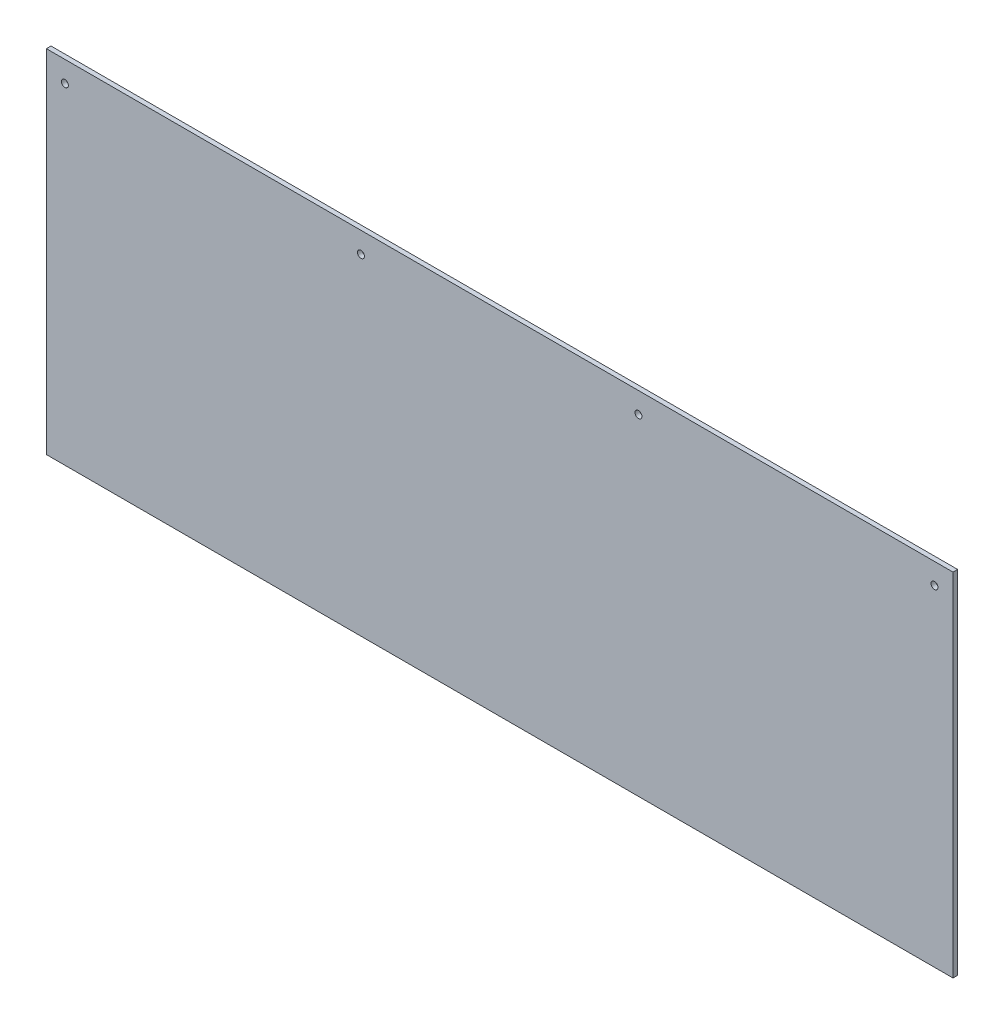
ISO-10303-21;
HEADER;
FILE_DESCRIPTION(('STEP AP214'),'2;1');
FILE_NAME('part.step','',(''),(''),'','','');
FILE_SCHEMA(('AUTOMOTIVE_DESIGN { 1 0 10303 214 1 1 1 1 }'));
ENDSEC;
DATA;
#1=APPLICATION_CONTEXT('core data for automotive mechanical design processes');
#2=APPLICATION_PROTOCOL_DEFINITION('international standard','automotive_design',2000,#1);
#3=PRODUCT_CONTEXT('',#1,'mechanical');
#4=PRODUCT('Part','Part','',(#3));
#5=PRODUCT_RELATED_PRODUCT_CATEGORY('part','',(#4));
#6=PRODUCT_DEFINITION_FORMATION('','',#4);
#7=PRODUCT_DEFINITION_CONTEXT('part definition',#1,'design');
#8=PRODUCT_DEFINITION('design','',#6,#7);
#9=PRODUCT_DEFINITION_SHAPE('','',#8);
#10=(LENGTH_UNIT() NAMED_UNIT(*) SI_UNIT(.MILLI.,.METRE.));
#11=(NAMED_UNIT(*) PLANE_ANGLE_UNIT() SI_UNIT($,.RADIAN.));
#12=(NAMED_UNIT(*) SI_UNIT($,.STERADIAN.) SOLID_ANGLE_UNIT());
#13=UNCERTAINTY_MEASURE_WITH_UNIT(LENGTH_MEASURE(1.E-05),#10,'distance_accuracy_value','');
#14=(GEOMETRIC_REPRESENTATION_CONTEXT(3) GLOBAL_UNCERTAINTY_ASSIGNED_CONTEXT((#13)) GLOBAL_UNIT_ASSIGNED_CONTEXT((#10,
#11,#12)) REPRESENTATION_CONTEXT('',''));
#15=CARTESIAN_POINT('',(0.,0.,0.));
#16=DIRECTION('',(0.,0.,1.));
#17=DIRECTION('',(1.,0.,0.));
#18=AXIS2_PLACEMENT_3D('',#15,#16,#17);
#19=CARTESIAN_POINT('',(0.,0.,6.35));
#20=DIRECTION('',(0.,0.,1.));
#21=DIRECTION('',(1.,0.,0.));
#22=AXIS2_PLACEMENT_3D('',#19,#20,#21);
#23=PLANE('',#22);
#24=CARTESIAN_POINT('',(1219.2,454.025,6.35));
#25=DIRECTION('',(0.,0.,1.));
#26=DIRECTION('',(1.,0.,0.));
#27=AXIS2_PLACEMENT_3D('',#24,#25,#26);
#28=CIRCLE('',#27,4.7625);
#29=CARTESIAN_POINT('',(1223.9625,454.025,6.35));
#30=VERTEX_POINT('',#29);
#31=EDGE_CURVE('E92',#30,#30,#28,.F.);
#32=ORIENTED_EDGE('',*,*,#31,.T.);
#33=EDGE_LOOP('',(#32));
#34=FACE_BOUND('',#33,.T.);
#35=CARTESIAN_POINT('',(812.8,454.025,6.35));
#36=DIRECTION('',(0.,0.,1.));
#37=DIRECTION('',(1.,0.,0.));
#38=AXIS2_PLACEMENT_3D('',#35,#36,#37);
#39=CIRCLE('',#38,4.7625);
#40=CARTESIAN_POINT('',(817.5625,454.025,6.35));
#41=VERTEX_POINT('',#40);
#42=EDGE_CURVE('E95',#41,#41,#39,.F.);
#43=ORIENTED_EDGE('',*,*,#42,.T.);
#44=EDGE_LOOP('',(#43));
#45=FACE_BOUND('',#44,.T.);
#46=CARTESIAN_POINT('',(431.8,454.025,6.35));
#47=DIRECTION('',(0.,0.,1.));
#48=DIRECTION('',(1.,0.,0.));
#49=AXIS2_PLACEMENT_3D('',#46,#47,#48);
#50=CIRCLE('',#49,4.7625);
#51=CARTESIAN_POINT('',(436.5625,454.025,6.35));
#52=VERTEX_POINT('',#51);
#53=EDGE_CURVE('E97',#52,#52,#50,.F.);
#54=ORIENTED_EDGE('',*,*,#53,.T.);
#55=EDGE_LOOP('',(#54));
#56=FACE_BOUND('',#55,.T.);
#57=CARTESIAN_POINT('',(25.4,454.025,6.35));
#58=DIRECTION('',(0.,0.,1.));
#59=DIRECTION('',(1.,0.,0.));
#60=AXIS2_PLACEMENT_3D('',#57,#58,#59);
#61=CIRCLE('',#60,4.7625);
#62=CARTESIAN_POINT('',(30.1625,454.025,6.35));
#63=VERTEX_POINT('',#62);
#64=EDGE_CURVE('E20',#63,#63,#61,.F.);
#65=ORIENTED_EDGE('',*,*,#64,.T.);
#66=EDGE_LOOP('',(#65));
#67=FACE_BOUND('',#66,.T.);
#68=DIRECTION('',(0.,1.,0.));
#69=VECTOR('',#68,1.);
#70=CARTESIAN_POINT('',(0.,482.6,6.35));
#71=LINE('',#70,#69);
#72=CARTESIAN_POINT('',(0.,0.,6.35));
#73=VERTEX_POINT('',#72);
#74=CARTESIAN_POINT('',(0.,482.6,6.35));
#75=VERTEX_POINT('',#74);
#76=EDGE_CURVE('E71',#73,#75,#71,.T.);
#77=ORIENTED_EDGE('',*,*,#76,.F.);
#78=DIRECTION('',(1.,0.,0.));
#79=VECTOR('',#78,1.);
#80=CARTESIAN_POINT('',(0.,0.,6.35));
#81=LINE('',#80,#79);
#82=CARTESIAN_POINT('',(1244.6,0.,6.35));
#83=VERTEX_POINT('',#82);
#84=EDGE_CURVE('E68',#83,#73,#81,.F.);
#85=ORIENTED_EDGE('',*,*,#84,.F.);
#86=DIRECTION('',(0.,1.,0.));
#87=VECTOR('',#86,1.);
#88=CARTESIAN_POINT('',(1244.6,0.,6.35));
#89=LINE('',#88,#87);
#90=CARTESIAN_POINT('',(1244.6,482.6,6.35));
#91=VERTEX_POINT('',#90);
#92=EDGE_CURVE('E59',#91,#83,#89,.F.);
#93=ORIENTED_EDGE('',*,*,#92,.F.);
#94=DIRECTION('',(1.,0.,0.));
#95=VECTOR('',#94,1.);
#96=CARTESIAN_POINT('',(1244.6,482.6,6.35));
#97=LINE('',#96,#95);
#98=EDGE_CURVE('E54',#75,#91,#97,.T.);
#99=ORIENTED_EDGE('',*,*,#98,.F.);
#100=EDGE_LOOP('',(#77,#85,#93,#99));
#101=FACE_BOUND('',#100,.T.);
#102=ADVANCED_FACE('F17',(#34,#45,#56,#67,#101),#23,.T.);
#103=CARTESIAN_POINT('',(0.,0.,0.));
#104=DIRECTION('',(0.,-1.,0.));
#105=DIRECTION('',(0.,0.,-1.));
#106=AXIS2_PLACEMENT_3D('',#103,#104,#105);
#107=PLANE('',#106);
#108=DIRECTION('',(0.,0.,1.));
#109=VECTOR('',#108,1.);
#110=CARTESIAN_POINT('',(0.,0.,0.));
#111=LINE('',#110,#109);
#112=CARTESIAN_POINT('',(0.,0.,0.));
#113=VERTEX_POINT('',#112);
#114=EDGE_CURVE('E105',#113,#73,#111,.T.);
#115=ORIENTED_EDGE('',*,*,#114,.F.);
#116=DIRECTION('',(1.,0.,0.));
#117=VECTOR('',#116,1.);
#118=CARTESIAN_POINT('',(0.,0.,0.));
#119=LINE('',#118,#117);
#120=CARTESIAN_POINT('',(1244.6,0.,0.));
#121=VERTEX_POINT('',#120);
#122=EDGE_CURVE('E78',#113,#121,#119,.T.);
#123=ORIENTED_EDGE('',*,*,#122,.T.);
#124=DIRECTION('',(0.,0.,-1.));
#125=VECTOR('',#124,1.);
#126=CARTESIAN_POINT('',(1244.6,0.,0.));
#127=LINE('',#126,#125);
#128=EDGE_CURVE('E64',#83,#121,#127,.T.);
#129=ORIENTED_EDGE('',*,*,#128,.F.);
#130=ORIENTED_EDGE('',*,*,#84,.T.);
#131=EDGE_LOOP('',(#115,#123,#129,#130));
#132=FACE_BOUND('',#131,.T.);
#133=ADVANCED_FACE('F77',(#132),#107,.T.);
#134=CARTESIAN_POINT('',(1244.6,0.,0.));
#135=DIRECTION('',(1.,0.,0.));
#136=DIRECTION('',(0.,0.,-1.));
#137=AXIS2_PLACEMENT_3D('',#134,#135,#136);
#138=PLANE('',#137);
#139=ORIENTED_EDGE('',*,*,#128,.T.);
#140=DIRECTION('',(0.,1.,0.));
#141=VECTOR('',#140,1.);
#142=CARTESIAN_POINT('',(1244.6,0.,0.));
#143=LINE('',#142,#141);
#144=CARTESIAN_POINT('',(1244.6,482.6,0.));
#145=VERTEX_POINT('',#144);
#146=EDGE_CURVE('E116',#121,#145,#143,.T.);
#147=ORIENTED_EDGE('',*,*,#146,.T.);
#148=DIRECTION('',(0.,0.,1.));
#149=VECTOR('',#148,1.);
#150=CARTESIAN_POINT('',(1244.6,482.6,0.));
#151=LINE('',#150,#149);
#152=EDGE_CURVE('E66',#91,#145,#151,.F.);
#153=ORIENTED_EDGE('',*,*,#152,.F.);
#154=ORIENTED_EDGE('',*,*,#92,.T.);
#155=EDGE_LOOP('',(#139,#147,#153,#154));
#156=FACE_BOUND('',#155,.T.);
#157=ADVANCED_FACE('F61',(#156),#138,.T.);
#158=CARTESIAN_POINT('',(1244.6,482.6,0.));
#159=DIRECTION('',(0.,1.,0.));
#160=DIRECTION('',(0.,0.,1.));
#161=AXIS2_PLACEMENT_3D('',#158,#159,#160);
#162=PLANE('',#161);
#163=ORIENTED_EDGE('',*,*,#152,.T.);
#164=DIRECTION('',(1.,0.,0.));
#165=VECTOR('',#164,1.);
#166=CARTESIAN_POINT('',(0.,482.6,0.));
#167=LINE('',#166,#165);
#168=CARTESIAN_POINT('',(0.,482.6,0.));
#169=VERTEX_POINT('',#168);
#170=EDGE_CURVE('E113',#145,#169,#167,.F.);
#171=ORIENTED_EDGE('',*,*,#170,.T.);
#172=DIRECTION('',(0.,0.,1.));
#173=VECTOR('',#172,1.);
#174=CARTESIAN_POINT('',(0.,482.6,0.));
#175=LINE('',#174,#173);
#176=EDGE_CURVE('E35',#75,#169,#175,.F.);
#177=ORIENTED_EDGE('',*,*,#176,.F.);
#178=ORIENTED_EDGE('',*,*,#98,.T.);
#179=EDGE_LOOP('',(#163,#171,#177,#178));
#180=FACE_BOUND('',#179,.T.);
#181=ADVANCED_FACE('F112',(#180),#162,.T.);
#182=CARTESIAN_POINT('',(0.,482.6,0.));
#183=DIRECTION('',(-1.,0.,0.));
#184=DIRECTION('',(0.,0.,1.));
#185=AXIS2_PLACEMENT_3D('',#182,#183,#184);
#186=PLANE('',#185);
#187=ORIENTED_EDGE('',*,*,#176,.T.);
#188=DIRECTION('',(0.,1.,0.));
#189=VECTOR('',#188,1.);
#190=CARTESIAN_POINT('',(0.,0.,0.));
#191=LINE('',#190,#189);
#192=EDGE_CURVE('E91',#169,#113,#191,.F.);
#193=ORIENTED_EDGE('',*,*,#192,.T.);
#194=ORIENTED_EDGE('',*,*,#114,.T.);
#195=ORIENTED_EDGE('',*,*,#76,.T.);
#196=EDGE_LOOP('',(#187,#193,#194,#195));
#197=FACE_BOUND('',#196,.T.);
#198=ADVANCED_FACE('F119',(#197),#186,.T.);
#199=CARTESIAN_POINT('',(25.4,454.025,0.));
#200=DIRECTION('',(0.,0.,1.));
#201=DIRECTION('',(1.,0.,0.));
#202=AXIS2_PLACEMENT_3D('',#199,#200,#201);
#203=CYLINDRICAL_SURFACE('',#202,4.7625);
#204=ORIENTED_EDGE('',*,*,#64,.F.);
#205=EDGE_LOOP('',(#204));
#206=FACE_BOUND('',#205,.T.);
#207=CARTESIAN_POINT('',(25.4,454.025,0.));
#208=DIRECTION('',(0.,0.,1.));
#209=DIRECTION('',(1.,0.,0.));
#210=AXIS2_PLACEMENT_3D('',#207,#208,#209);
#211=CIRCLE('',#210,4.7625);
#212=CARTESIAN_POINT('',(30.1625,454.025,0.));
#213=VERTEX_POINT('',#212);
#214=EDGE_CURVE('E88',#213,#213,#211,.F.);
#215=ORIENTED_EDGE('',*,*,#214,.T.);
#216=EDGE_LOOP('',(#215));
#217=FACE_BOUND('',#216,.T.);
#218=ADVANCED_FACE('F121',(#206,#217),#203,.F.);
#219=CARTESIAN_POINT('',(431.8,454.025,0.));
#220=DIRECTION('',(0.,0.,1.));
#221=DIRECTION('',(1.,0.,0.));
#222=AXIS2_PLACEMENT_3D('',#219,#220,#221);
#223=CYLINDRICAL_SURFACE('',#222,4.7625);
#224=ORIENTED_EDGE('',*,*,#53,.F.);
#225=EDGE_LOOP('',(#224));
#226=FACE_BOUND('',#225,.T.);
#227=CARTESIAN_POINT('',(431.8,454.025,0.));
#228=DIRECTION('',(0.,0.,1.));
#229=DIRECTION('',(1.,0.,0.));
#230=AXIS2_PLACEMENT_3D('',#227,#228,#229);
#231=CIRCLE('',#230,4.7625);
#232=CARTESIAN_POINT('',(436.5625,454.025,0.));
#233=VERTEX_POINT('',#232);
#234=EDGE_CURVE('E85',#233,#233,#231,.F.);
#235=ORIENTED_EDGE('',*,*,#234,.T.);
#236=EDGE_LOOP('',(#235));
#237=FACE_BOUND('',#236,.T.);
#238=ADVANCED_FACE('F128',(#226,#237),#223,.F.);
#239=CARTESIAN_POINT('',(812.8,454.025,0.));
#240=DIRECTION('',(0.,0.,1.));
#241=DIRECTION('',(1.,0.,0.));
#242=AXIS2_PLACEMENT_3D('',#239,#240,#241);
#243=CYLINDRICAL_SURFACE('',#242,4.7625);
#244=ORIENTED_EDGE('',*,*,#42,.F.);
#245=EDGE_LOOP('',(#244));
#246=FACE_BOUND('',#245,.T.);
#247=CARTESIAN_POINT('',(812.8,454.025,0.));
#248=DIRECTION('',(0.,0.,1.));
#249=DIRECTION('',(1.,0.,0.));
#250=AXIS2_PLACEMENT_3D('',#247,#248,#249);
#251=CIRCLE('',#250,4.7625);
#252=CARTESIAN_POINT('',(817.5625,454.025,0.));
#253=VERTEX_POINT('',#252);
#254=EDGE_CURVE('E26',#253,#253,#251,.F.);
#255=ORIENTED_EDGE('',*,*,#254,.T.);
#256=EDGE_LOOP('',(#255));
#257=FACE_BOUND('',#256,.T.);
#258=ADVANCED_FACE('F139',(#246,#257),#243,.F.);
#259=CARTESIAN_POINT('',(1219.2,454.025,0.));
#260=DIRECTION('',(0.,0.,1.));
#261=DIRECTION('',(1.,0.,0.));
#262=AXIS2_PLACEMENT_3D('',#259,#260,#261);
#263=CYLINDRICAL_SURFACE('',#262,4.7625);
#264=ORIENTED_EDGE('',*,*,#31,.F.);
#265=EDGE_LOOP('',(#264));
#266=FACE_BOUND('',#265,.T.);
#267=CARTESIAN_POINT('',(1219.2,454.025,0.));
#268=DIRECTION('',(0.,0.,1.));
#269=DIRECTION('',(1.,0.,0.));
#270=AXIS2_PLACEMENT_3D('',#267,#268,#269);
#271=CIRCLE('',#270,4.7625);
#272=CARTESIAN_POINT('',(1223.9625,454.025,0.));
#273=VERTEX_POINT('',#272);
#274=EDGE_CURVE('E11',#273,#273,#271,.F.);
#275=ORIENTED_EDGE('',*,*,#274,.T.);
#276=EDGE_LOOP('',(#275));
#277=FACE_BOUND('',#276,.T.);
#278=ADVANCED_FACE('F133',(#266,#277),#263,.F.);
#279=CARTESIAN_POINT('',(0.,0.,0.));
#280=DIRECTION('',(0.,0.,1.));
#281=DIRECTION('',(1.,0.,0.));
#282=AXIS2_PLACEMENT_3D('',#279,#280,#281);
#283=PLANE('',#282);
#284=ORIENTED_EDGE('',*,*,#274,.F.);
#285=EDGE_LOOP('',(#284));
#286=FACE_BOUND('',#285,.T.);
#287=ORIENTED_EDGE('',*,*,#254,.F.);
#288=EDGE_LOOP('',(#287));
#289=FACE_BOUND('',#288,.T.);
#290=ORIENTED_EDGE('',*,*,#234,.F.);
#291=EDGE_LOOP('',(#290));
#292=FACE_BOUND('',#291,.T.);
#293=ORIENTED_EDGE('',*,*,#214,.F.);
#294=EDGE_LOOP('',(#293));
#295=FACE_BOUND('',#294,.T.);
#296=ORIENTED_EDGE('',*,*,#170,.F.);
#297=ORIENTED_EDGE('',*,*,#146,.F.);
#298=ORIENTED_EDGE('',*,*,#122,.F.);
#299=ORIENTED_EDGE('',*,*,#192,.F.);
#300=EDGE_LOOP('',(#296,#297,#298,#299));
#301=FACE_BOUND('',#300,.T.);
#302=ADVANCED_FACE('F115',(#286,#289,#292,#295,#301),#283,.F.);
#303=CLOSED_SHELL('',(#102,#133,#157,#181,#198,#218,#238,#258,#278,#302));
#304=MANIFOLD_SOLID_BREP('B1',#303);
#305=ADVANCED_BREP_SHAPE_REPRESENTATION('',(#18,#304),#14);
#306=SHAPE_DEFINITION_REPRESENTATION(#9,#305);
ENDSEC;
END-ISO-10303-21;
